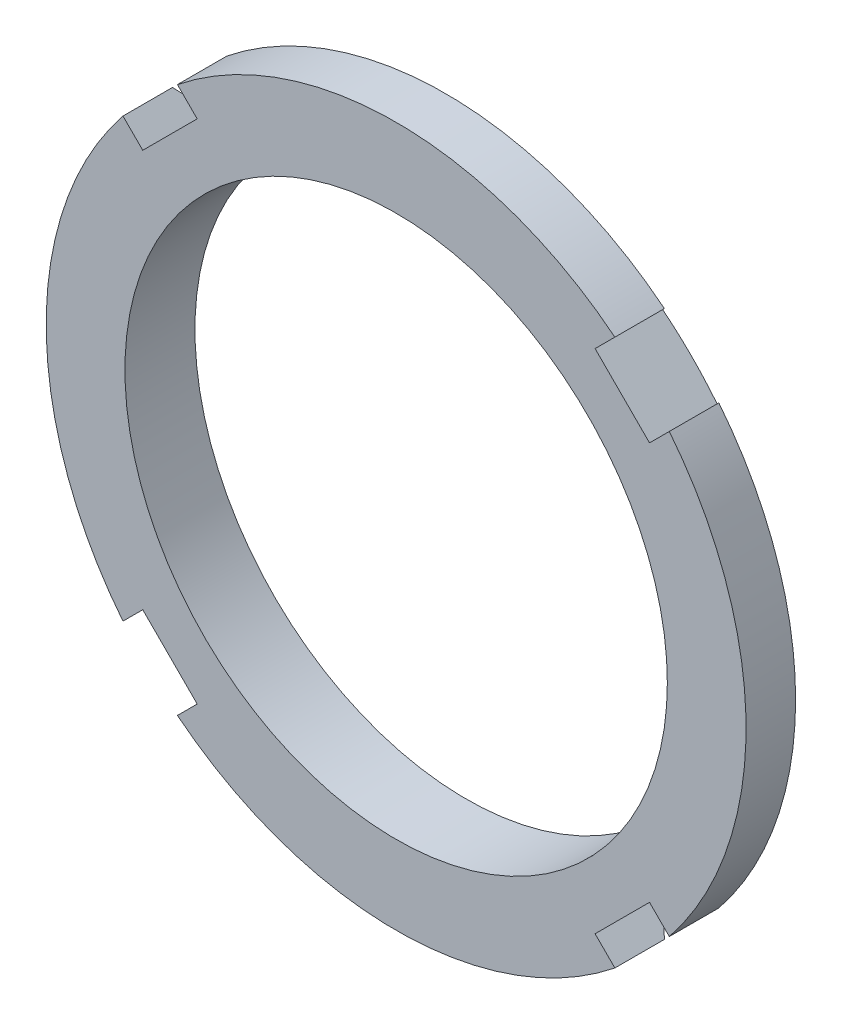
ISO-10303-21;
HEADER;
FILE_DESCRIPTION(('STEP AP214'),'2;1');
FILE_NAME('part.step','',(''),(''),'','','');
FILE_SCHEMA(('AUTOMOTIVE_DESIGN { 1 0 10303 214 1 1 1 1 }'));
ENDSEC;
DATA;
#1=APPLICATION_CONTEXT('core data for automotive mechanical design processes');
#2=APPLICATION_PROTOCOL_DEFINITION('international standard','automotive_design',2000,#1);
#3=PRODUCT_CONTEXT('',#1,'mechanical');
#4=PRODUCT('Part','Part','',(#3));
#5=PRODUCT_RELATED_PRODUCT_CATEGORY('part','',(#4));
#6=PRODUCT_DEFINITION_FORMATION('','',#4);
#7=PRODUCT_DEFINITION_CONTEXT('part definition',#1,'design');
#8=PRODUCT_DEFINITION('design','',#6,#7);
#9=PRODUCT_DEFINITION_SHAPE('','',#8);
#10=(LENGTH_UNIT() NAMED_UNIT(*) SI_UNIT(.MILLI.,.METRE.));
#11=(NAMED_UNIT(*) PLANE_ANGLE_UNIT() SI_UNIT($,.RADIAN.));
#12=(NAMED_UNIT(*) SI_UNIT($,.STERADIAN.) SOLID_ANGLE_UNIT());
#13=UNCERTAINTY_MEASURE_WITH_UNIT(LENGTH_MEASURE(1.E-05),#10,'distance_accuracy_value','');
#14=(GEOMETRIC_REPRESENTATION_CONTEXT(3) GLOBAL_UNCERTAINTY_ASSIGNED_CONTEXT((#13)) GLOBAL_UNIT_ASSIGNED_CONTEXT((#10,
#11,#12)) REPRESENTATION_CONTEXT('',''));
#15=CARTESIAN_POINT('',(0.,0.,0.));
#16=DIRECTION('',(0.,0.,1.));
#17=DIRECTION('',(1.,0.,0.));
#18=AXIS2_PLACEMENT_3D('',#15,#16,#17);
#19=CARTESIAN_POINT('',(0.,0.,10.));
#20=DIRECTION('',(0.,0.,-1.));
#21=DIRECTION('',(-1.,0.,0.));
#22=AXIS2_PLACEMENT_3D('',#19,#20,#21);
#23=CYLINDRICAL_SURFACE('',#22,50.);
#24=DIRECTION('',(0.,0.,1.));
#25=VECTOR('',#24,1.);
#26=CARTESIAN_POINT('',(-39.029875563154,31.2517009701026,0.));
#27=LINE('',#26,#25);
#28=CARTESIAN_POINT('',(-39.029875563154,31.2517009701026,2.92233416938876));
#29=VERTEX_POINT('',#28);
#30=CARTESIAN_POINT('',(-39.029875563154,31.2517009701026,10.));
#31=VERTEX_POINT('',#30);
#32=EDGE_CURVE('E255',#29,#31,#27,.T.);
#33=ORIENTED_EDGE('',*,*,#32,.F.);
#34=CARTESIAN_POINT('',(0.,0.,2.92233416938876));
#35=DIRECTION('',(0.,0.,1.));
#36=DIRECTION('',(1.,0.,0.));
#37=AXIS2_PLACEMENT_3D('',#34,#35,#36);
#38=CIRCLE('',#37,50.);
#39=CARTESIAN_POINT('',(-39.0298755631545,-31.2517009701021,2.92233416938876));
#40=VERTEX_POINT('',#39);
#41=EDGE_CURVE('E250',#29,#40,#38,.T.);
#42=ORIENTED_EDGE('',*,*,#41,.T.);
#43=DIRECTION('',(0.,0.,1.));
#44=VECTOR('',#43,1.);
#45=CARTESIAN_POINT('',(-39.0298755631545,-31.2517009701021,0.));
#46=LINE('',#45,#44);
#47=CARTESIAN_POINT('',(-39.0298755631545,-31.2517009701021,10.));
#48=VERTEX_POINT('',#47);
#49=EDGE_CURVE('E275',#40,#48,#46,.T.);
#50=ORIENTED_EDGE('',*,*,#49,.T.);
#51=CARTESIAN_POINT('',(0.,0.,10.));
#52=DIRECTION('',(0.,0.,1.));
#53=DIRECTION('',(1.,0.,0.));
#54=AXIS2_PLACEMENT_3D('',#51,#52,#53);
#55=CIRCLE('',#54,50.);
#56=EDGE_CURVE('E192',#31,#48,#55,.T.);
#57=ORIENTED_EDGE('',*,*,#56,.F.);
#58=EDGE_LOOP('',(#33,#42,#50,#57));
#59=FACE_BOUND('',#58,.T.);
#60=ADVANCED_FACE('F33',(#59),#23,.T.);
#61=DIRECTION('',(0.,0.,1.));
#62=VECTOR('',#61,1.);
#63=CARTESIAN_POINT('',(-31.2517009701025,-39.0298755631541,0.));
#64=LINE('',#63,#62);
#65=CARTESIAN_POINT('',(-31.2517009701025,-39.0298755631542,2.92233416938876));
#66=VERTEX_POINT('',#65);
#67=CARTESIAN_POINT('',(-31.2517009701025,-39.0298755631541,10.));
#68=VERTEX_POINT('',#67);
#69=EDGE_CURVE('E273',#66,#68,#64,.T.);
#70=ORIENTED_EDGE('',*,*,#69,.F.);
#71=CARTESIAN_POINT('',(31.2517009701022,-39.0298755631544,2.92233416938876));
#72=VERTEX_POINT('',#71);
#73=EDGE_CURVE('E169',#66,#72,#38,.T.);
#74=ORIENTED_EDGE('',*,*,#73,.T.);
#75=DIRECTION('',(0.,0.,1.));
#76=VECTOR('',#75,1.);
#77=CARTESIAN_POINT('',(31.2517009701022,-39.0298755631544,0.));
#78=LINE('',#77,#76);
#79=CARTESIAN_POINT('',(31.2517009701022,-39.0298755631544,10.));
#80=VERTEX_POINT('',#79);
#81=EDGE_CURVE('E218',#72,#80,#78,.T.);
#82=ORIENTED_EDGE('',*,*,#81,.T.);
#83=EDGE_CURVE('E197',#68,#80,#55,.T.);
#84=ORIENTED_EDGE('',*,*,#83,.F.);
#85=EDGE_LOOP('',(#70,#74,#82,#84));
#86=FACE_BOUND('',#85,.T.);
#87=ADVANCED_FACE('F394',(#86),#23,.T.);
#88=DIRECTION('',(0.,0.,1.));
#89=VECTOR('',#88,1.);
#90=CARTESIAN_POINT('',(39.0298755631542,-31.2517009701023,0.));
#91=LINE('',#90,#89);
#92=CARTESIAN_POINT('',(39.0298755631543,-31.2517009701023,2.92233416938876));
#93=VERTEX_POINT('',#92);
#94=CARTESIAN_POINT('',(39.0298755631542,-31.2517009701023,10.));
#95=VERTEX_POINT('',#94);
#96=EDGE_CURVE('E168',#93,#95,#91,.T.);
#97=ORIENTED_EDGE('',*,*,#96,.F.);
#98=CARTESIAN_POINT('',(39.0298755631542,31.2517009701023,2.92233416938876));
#99=VERTEX_POINT('',#98);
#100=EDGE_CURVE('E153',#93,#99,#38,.T.);
#101=ORIENTED_EDGE('',*,*,#100,.T.);
#102=DIRECTION('',(0.,0.,1.));
#103=VECTOR('',#102,1.);
#104=CARTESIAN_POINT('',(39.0298755631542,31.2517009701023,0.));
#105=LINE('',#104,#103);
#106=CARTESIAN_POINT('',(39.0298755631542,31.2517009701023,10.));
#107=VERTEX_POINT('',#106);
#108=EDGE_CURVE('E166',#99,#107,#105,.T.);
#109=ORIENTED_EDGE('',*,*,#108,.T.);
#110=EDGE_CURVE('E188',#95,#107,#55,.T.);
#111=ORIENTED_EDGE('',*,*,#110,.F.);
#112=EDGE_LOOP('',(#97,#101,#109,#111));
#113=FACE_BOUND('',#112,.T.);
#114=ADVANCED_FACE('F164',(#113),#23,.T.);
#115=CARTESIAN_POINT('',(0.,0.,10.));
#116=DIRECTION('',(0.,0.,1.));
#117=DIRECTION('',(1.,0.,0.));
#118=AXIS2_PLACEMENT_3D('',#115,#116,#117);
#119=PLANE('',#118);
#120=DIRECTION('',(0.707106781186542,-0.707106781186553,0.));
#121=VECTOR('',#120,1.);
#122=CARTESIAN_POINT('',(-39.029875563154,31.2517009701026,10.));
#123=LINE('',#122,#121);
#124=CARTESIAN_POINT('',(-36.203867196751,28.4256926036995,10.));
#125=VERTEX_POINT('',#124);
#126=EDGE_CURVE('E260',#31,#125,#123,.T.);
#127=ORIENTED_EDGE('',*,*,#126,.F.);
#128=ORIENTED_EDGE('',*,*,#56,.T.);
#129=DIRECTION('',(-0.707106781186552,-0.707106781186543,0.));
#130=VECTOR('',#129,1.);
#131=CARTESIAN_POINT('',(-39.0298755631545,-31.2517009701021,10.));
#132=LINE('',#131,#130);
#133=CARTESIAN_POINT('',(-36.2038671967514,-28.425692603699,10.));
#134=VERTEX_POINT('',#133);
#135=EDGE_CURVE('E267',#134,#48,#132,.T.);
#136=ORIENTED_EDGE('',*,*,#135,.F.);
#137=DIRECTION('',(-0.707106781186544,0.707106781186551,0.));
#138=VECTOR('',#137,1.);
#139=CARTESIAN_POINT('',(-28.4256926036994,-36.2038671967511,10.));
#140=LINE('',#139,#138);
#141=CARTESIAN_POINT('',(-28.4256926036994,-36.2038671967511,10.));
#142=VERTEX_POINT('',#141);
#143=EDGE_CURVE('E264',#142,#134,#140,.T.);
#144=ORIENTED_EDGE('',*,*,#143,.F.);
#145=DIRECTION('',(0.70710678118655,0.707106781186545,0.));
#146=VECTOR('',#145,1.);
#147=CARTESIAN_POINT('',(-31.2517009701025,-39.0298755631541,10.));
#148=LINE('',#147,#146);
#149=EDGE_CURVE('E211',#68,#142,#148,.T.);
#150=ORIENTED_EDGE('',*,*,#149,.F.);
#151=ORIENTED_EDGE('',*,*,#83,.T.);
#152=DIRECTION('',(0.707106781186545,-0.70710678118655,0.));
#153=VECTOR('',#152,1.);
#154=CARTESIAN_POINT('',(31.2517009701022,-39.0298755631544,10.));
#155=LINE('',#154,#153);
#156=CARTESIAN_POINT('',(28.4256926036992,-36.2038671967513,10.));
#157=VERTEX_POINT('',#156);
#158=EDGE_CURVE('E208',#157,#80,#155,.T.);
#159=ORIENTED_EDGE('',*,*,#158,.F.);
#160=DIRECTION('',(-0.707106781186549,-0.707106781186546,0.));
#161=VECTOR('',#160,1.);
#162=CARTESIAN_POINT('',(36.2038671967512,-28.4256926036993,10.));
#163=LINE('',#162,#161);
#164=CARTESIAN_POINT('',(36.2038671967512,-28.4256926036993,10.));
#165=VERTEX_POINT('',#164);
#166=EDGE_CURVE('E223',#165,#157,#163,.T.);
#167=ORIENTED_EDGE('',*,*,#166,.F.);
#168=DIRECTION('',(-0.707106781186547,0.707106781186548,0.));
#169=VECTOR('',#168,1.);
#170=CARTESIAN_POINT('',(39.0298755631542,-31.2517009701023,10.));
#171=LINE('',#170,#169);
#172=EDGE_CURVE('E222',#95,#165,#171,.T.);
#173=ORIENTED_EDGE('',*,*,#172,.F.);
#174=ORIENTED_EDGE('',*,*,#110,.T.);
#175=DIRECTION('',(0.707106781186548,0.707106781186548,0.));
#176=VECTOR('',#175,1.);
#177=CARTESIAN_POINT('',(39.0298755631542,31.2517009701023,10.));
#178=LINE('',#177,#176);
#179=CARTESIAN_POINT('',(36.2038671967512,28.4256926036993,10.));
#180=VERTEX_POINT('',#179);
#181=EDGE_CURVE('E175',#180,#107,#178,.T.);
#182=ORIENTED_EDGE('',*,*,#181,.F.);
#183=DIRECTION('',(0.707106781186549,-0.707106781186546,0.));
#184=VECTOR('',#183,1.);
#185=CARTESIAN_POINT('',(28.4256926036991,36.2038671967513,10.));
#186=LINE('',#185,#184);
#187=CARTESIAN_POINT('',(28.4256926036991,36.2038671967513,10.));
#188=VERTEX_POINT('',#187);
#189=EDGE_CURVE('E233',#188,#180,#186,.T.);
#190=ORIENTED_EDGE('',*,*,#189,.F.);
#191=DIRECTION('',(-0.707106781186545,-0.70710678118655,0.));
#192=VECTOR('',#191,1.);
#193=CARTESIAN_POINT('',(31.2517009701022,39.0298755631544,10.));
#194=LINE('',#193,#192);
#195=CARTESIAN_POINT('',(31.2517009701022,39.0298755631544,10.));
#196=VERTEX_POINT('',#195);
#197=EDGE_CURVE('E181',#196,#188,#194,.T.);
#198=ORIENTED_EDGE('',*,*,#197,.F.);
#199=CARTESIAN_POINT('',(-31.2517009701019,39.0298755631546,10.));
#200=VERTEX_POINT('',#199);
#201=EDGE_CURVE('E46',#196,#200,#55,.T.);
#202=ORIENTED_EDGE('',*,*,#201,.T.);
#203=DIRECTION('',(-0.70710678118654,0.707106781186555,0.));
#204=VECTOR('',#203,1.);
#205=CARTESIAN_POINT('',(-31.2517009701019,39.0298755631546,10.));
#206=LINE('',#205,#204);
#207=CARTESIAN_POINT('',(-28.4256926036989,36.2038671967515,10.));
#208=VERTEX_POINT('',#207);
#209=EDGE_CURVE('E254',#208,#200,#206,.T.);
#210=ORIENTED_EDGE('',*,*,#209,.F.);
#211=DIRECTION('',(0.707106781186554,0.707106781186541,0.));
#212=VECTOR('',#211,1.);
#213=CARTESIAN_POINT('',(-36.203867196751,28.4256926036995,10.));
#214=LINE('',#213,#212);
#215=EDGE_CURVE('E408',#125,#208,#214,.T.);
#216=ORIENTED_EDGE('',*,*,#215,.F.);
#217=EDGE_LOOP('',(#127,#128,#136,#144,#150,#151,#159,#167,#173,#174,#182,#190,#198,#202,#210,#216));
#218=FACE_BOUND('',#217,.T.);
#219=CARTESIAN_POINT('',(0.,0.,10.));
#220=DIRECTION('',(0.,0.,1.));
#221=DIRECTION('',(1.,0.,0.));
#222=AXIS2_PLACEMENT_3D('',#219,#220,#221);
#223=CIRCLE('',#222,38.75);
#224=CARTESIAN_POINT('',(38.75,0.,10.));
#225=VERTEX_POINT('',#224);
#226=EDGE_CURVE('E185',#225,#225,#223,.T.);
#227=ORIENTED_EDGE('',*,*,#226,.F.);
#228=EDGE_LOOP('',(#227));
#229=FACE_BOUND('',#228,.T.);
#230=ADVANCED_FACE('F205',(#218,#229),#119,.T.);
#231=CARTESIAN_POINT('',(0.,0.,0.));
#232=DIRECTION('',(0.,0.,1.));
#233=DIRECTION('',(1.,0.,0.));
#234=AXIS2_PLACEMENT_3D('',#231,#232,#233);
#235=PLANE('',#234);
#236=CARTESIAN_POINT('',(0.,0.,0.));
#237=DIRECTION('',(0.,0.,1.));
#238=DIRECTION('',(1.,0.,0.));
#239=AXIS2_PLACEMENT_3D('',#236,#237,#238);
#240=CIRCLE('',#239,45.5);
#241=CARTESIAN_POINT('',(45.5,0.,0.));
#242=VERTEX_POINT('',#241);
#243=EDGE_CURVE('E249',#242,#242,#240,.T.);
#244=ORIENTED_EDGE('',*,*,#243,.F.);
#245=EDGE_LOOP('',(#244));
#246=FACE_BOUND('',#245,.T.);
#247=CARTESIAN_POINT('',(0.,0.,0.));
#248=DIRECTION('',(0.,0.,1.));
#249=DIRECTION('',(1.,0.,0.));
#250=AXIS2_PLACEMENT_3D('',#247,#248,#249);
#251=CIRCLE('',#250,38.75);
#252=CARTESIAN_POINT('',(38.75,0.,0.));
#253=VERTEX_POINT('',#252);
#254=EDGE_CURVE('E189',#253,#253,#251,.T.);
#255=ORIENTED_EDGE('',*,*,#254,.T.);
#256=EDGE_LOOP('',(#255));
#257=FACE_BOUND('',#256,.T.);
#258=ADVANCED_FACE('F385',(#246,#257),#235,.F.);
#259=DIRECTION('',(0.,0.,1.));
#260=VECTOR('',#259,1.);
#261=CARTESIAN_POINT('',(31.2517009701022,39.0298755631544,0.));
#262=LINE('',#261,#260);
#263=CARTESIAN_POINT('',(31.2517009701022,39.0298755631544,2.92233416938876));
#264=VERTEX_POINT('',#263);
#265=EDGE_CURVE('E176',#264,#196,#262,.T.);
#266=ORIENTED_EDGE('',*,*,#265,.F.);
#267=CARTESIAN_POINT('',(-31.2517009701019,39.0298755631546,2.92233416938876));
#268=VERTEX_POINT('',#267);
#269=EDGE_CURVE('E171',#264,#268,#38,.T.);
#270=ORIENTED_EDGE('',*,*,#269,.T.);
#271=DIRECTION('',(0.,0.,1.));
#272=VECTOR('',#271,1.);
#273=CARTESIAN_POINT('',(-31.2517009701019,39.0298755631546,0.));
#274=LINE('',#273,#272);
#275=EDGE_CURVE('E60',#268,#200,#274,.T.);
#276=ORIENTED_EDGE('',*,*,#275,.T.);
#277=ORIENTED_EDGE('',*,*,#201,.F.);
#278=EDGE_LOOP('',(#266,#270,#276,#277));
#279=FACE_BOUND('',#278,.T.);
#280=ADVANCED_FACE('F35',(#279),#23,.T.);
#281=CARTESIAN_POINT('',(0.,0.,10.));
#282=DIRECTION('',(0.,0.,-1.));
#283=DIRECTION('',(-1.,0.,0.));
#284=AXIS2_PLACEMENT_3D('',#281,#282,#283);
#285=CYLINDRICAL_SURFACE('',#284,38.75);
#286=ORIENTED_EDGE('',*,*,#226,.T.);
#287=EDGE_LOOP('',(#286));
#288=FACE_BOUND('',#287,.T.);
#289=ORIENTED_EDGE('',*,*,#254,.F.);
#290=EDGE_LOOP('',(#289));
#291=FACE_BOUND('',#290,.T.);
#292=ADVANCED_FACE('F379',(#288,#291),#285,.F.);
#293=CARTESIAN_POINT('',(28.4256926036991,36.2038671967513,0.));
#294=DIRECTION('',(-0.707106781186546,-0.707106781186549,0.));
#295=DIRECTION('',(0.707106781186549,-0.707106781186546,0.));
#296=AXIS2_PLACEMENT_3D('',#293,#294,#295);
#297=PLANE('',#296);
#298=DIRECTION('',(0.,0.,1.));
#299=VECTOR('',#298,1.);
#300=CARTESIAN_POINT('',(36.2038671967512,28.4256926036993,0.));
#301=LINE('',#300,#299);
#302=CARTESIAN_POINT('',(36.2038671967512,28.4256926036993,0.344038591718503));
#303=VERTEX_POINT('',#302);
#304=EDGE_CURVE('E177',#303,#180,#301,.T.);
#305=ORIENTED_EDGE('',*,*,#304,.F.);
#306=CARTESIAN_POINT('',(36.2040671967512,28.4254926036993,0.344060539833136));
#307=CARTESIAN_POINT('',(35.8803581287333,28.7492016717172,0.308531484594854));
#308=CARTESIAN_POINT('',(35.556416429512,29.0731433709385,0.277357668174083));
#309=CARTESIAN_POINT('',(34.908166729728,29.7213930707225,0.223825816086874));
#310=CARTESIAN_POINT('',(34.5838587263443,30.0457010741061,0.20146784878523));
#311=CARTESIAN_POINT('',(33.6115550066865,31.0180047937639,0.147832326833317));
#312=CARTESIAN_POINT('',(32.9631674534558,31.6663923469946,0.129881518639509));
#313=CARTESIAN_POINT('',(31.6663923469945,32.963167453456,0.129881518639509));
#314=CARTESIAN_POINT('',(31.0180047937638,33.6115550066866,0.147832326833317));
#315=CARTESIAN_POINT('',(30.045701074106,34.5838587263444,0.201467848785231));
#316=CARTESIAN_POINT('',(29.7213930707223,34.9081667297281,0.223825816086876));
#317=CARTESIAN_POINT('',(29.0731433709384,35.5564164295121,0.277357668174086));
#318=CARTESIAN_POINT('',(28.749201671717,35.8803581287334,0.308531484594859));
#319=CARTESIAN_POINT('',(28.4254926036991,36.2040671967513,0.34406053983314));
#320=B_SPLINE_CURVE_WITH_KNOTS('',3,(#306,#307,#308,#309,#310,#311,#312,#313,#314,#315,#316,
#317,#318,#319),.UNSPECIFIED.,.F.,.F.,(4,2,2,2,2,2,4),(0.,1.37747131070928,2.75495330316771,
5.50561311074742,8.25627291832713,9.63375491078556,11.0112262214948),.UNSPECIFIED.);
#321=CARTESIAN_POINT('',(28.4256926036991,36.2038671967513,0.344038591718506));
#322=VERTEX_POINT('',#321);
#323=EDGE_CURVE('E156',#303,#322,#320,.T.);
#324=ORIENTED_EDGE('',*,*,#323,.T.);
#325=DIRECTION('',(0.,0.,1.));
#326=VECTOR('',#325,1.);
#327=CARTESIAN_POINT('',(28.4256926036991,36.2038671967513,0.));
#328=LINE('',#327,#326);
#329=EDGE_CURVE('E179',#322,#188,#328,.T.);
#330=ORIENTED_EDGE('',*,*,#329,.T.);
#331=ORIENTED_EDGE('',*,*,#189,.T.);
#332=EDGE_LOOP('',(#305,#324,#330,#331));
#333=FACE_BOUND('',#332,.T.);
#334=ADVANCED_FACE('F243',(#333),#297,.F.);
#335=CARTESIAN_POINT('',(31.2517009701022,39.0298755631544,0.));
#336=DIRECTION('',(-0.70710678118655,0.707106781186545,0.));
#337=DIRECTION('',(-0.707106781186545,-0.70710678118655,0.));
#338=AXIS2_PLACEMENT_3D('',#335,#336,#337);
#339=PLANE('',#338);
#340=ORIENTED_EDGE('',*,*,#329,.F.);
#341=CARTESIAN_POINT('',(28.4254926036991,36.2036671967513,0.343856227468963));
#342=CARTESIAN_POINT('',(28.8966369074373,36.6748115004895,0.773465844116193));
#343=CARTESIAN_POINT('',(29.3677430899932,37.1459176830454,1.20315902820334));
#344=CARTESIAN_POINT('',(30.3098792121275,38.0880538051796,2.0627125306982));
#345=CARTESIAN_POINT('',(30.7809091517059,38.5590837447581,2.4925728491057));
#346=CARTESIAN_POINT('',(31.2519009701022,39.0300755631544,2.92251673495289));
#347=B_SPLINE_CURVE_WITH_KNOTS('',3,(#341,#342,#343,#344,#345,#346),.UNSPECIFIED.,.F.,.F.,(4,2,
4),(0.,2.37837438735404,4.75674877161307),.UNSPECIFIED.);
#348=EDGE_CURVE('E370',#322,#264,#347,.T.);
#349=ORIENTED_EDGE('',*,*,#348,.T.);
#350=ORIENTED_EDGE('',*,*,#265,.T.);
#351=ORIENTED_EDGE('',*,*,#197,.T.);
#352=EDGE_LOOP('',(#340,#349,#350,#351));
#353=FACE_BOUND('',#352,.T.);
#354=ADVANCED_FACE('F247',(#353),#339,.F.);
#355=CARTESIAN_POINT('',(39.0298755631542,31.2517009701023,0.));
#356=DIRECTION('',(0.707106781186548,-0.707106781186548,0.));
#357=DIRECTION('',(0.707106781186548,0.707106781186548,0.));
#358=AXIS2_PLACEMENT_3D('',#355,#356,#357);
#359=PLANE('',#358);
#360=ORIENTED_EDGE('',*,*,#108,.F.);
#361=CARTESIAN_POINT('',(39.0300755631542,31.2519009701023,2.92251673495291));
#362=CARTESIAN_POINT('',(38.559083744758,30.7809091517061,2.49257284910571));
#363=CARTESIAN_POINT('',(38.0880538051795,30.3098792121276,2.06271253069821));
#364=CARTESIAN_POINT('',(37.1459176830453,29.3677430899934,1.20315902820334));
#365=CARTESIAN_POINT('',(36.6748115004894,28.8966369074375,0.773465844116191));
#366=CARTESIAN_POINT('',(36.2036671967512,28.4254926036993,0.343856227468958));
#367=B_SPLINE_CURVE_WITH_KNOTS('',3,(#361,#362,#363,#364,#365,#366),.UNSPECIFIED.,.F.,.F.,(4,2,
4),(0.,2.37837438425904,4.75674877161309),.UNSPECIFIED.);
#368=EDGE_CURVE('E150',#99,#303,#367,.T.);
#369=ORIENTED_EDGE('',*,*,#368,.T.);
#370=ORIENTED_EDGE('',*,*,#304,.T.);
#371=ORIENTED_EDGE('',*,*,#181,.T.);
#372=EDGE_LOOP('',(#360,#369,#370,#371));
#373=FACE_BOUND('',#372,.T.);
#374=ADVANCED_FACE('F173',(#373),#359,.F.);
#375=CARTESIAN_POINT('',(36.2038671967512,-28.4256926036993,0.));
#376=DIRECTION('',(-0.707106781186546,0.707106781186549,0.));
#377=DIRECTION('',(-0.707106781186549,-0.707106781186546,0.));
#378=AXIS2_PLACEMENT_3D('',#375,#376,#377);
#379=PLANE('',#378);
#380=DIRECTION('',(0.,0.,1.));
#381=VECTOR('',#380,1.);
#382=CARTESIAN_POINT('',(28.4256926036992,-36.2038671967513,0.));
#383=LINE('',#382,#381);
#384=CARTESIAN_POINT('',(28.4256926036992,-36.2038671967513,0.344038591718503));
#385=VERTEX_POINT('',#384);
#386=EDGE_CURVE('E220',#385,#157,#383,.T.);
#387=ORIENTED_EDGE('',*,*,#386,.F.);
#388=CARTESIAN_POINT('',(28.4254926036992,-36.2040671967513,0.344060539833137));
#389=CARTESIAN_POINT('',(28.7492016717171,-35.8803581287334,0.308531484594855));
#390=CARTESIAN_POINT('',(29.0731433709384,-35.5564164295121,0.277357668174083));
#391=CARTESIAN_POINT('',(29.7213930707223,-34.9081667297281,0.223825816086875));
#392=CARTESIAN_POINT('',(30.045701074106,-34.5838587263444,0.201467848785231));
#393=CARTESIAN_POINT('',(31.0180047937638,-33.6115550066866,0.147832326833318));
#394=CARTESIAN_POINT('',(31.6663923469945,-32.963167453456,0.129881518639509));
#395=CARTESIAN_POINT('',(32.9631674534559,-31.6663923469946,0.129881518639509));
#396=CARTESIAN_POINT('',(33.6115550066865,-31.0180047937639,0.147832326833318));
#397=CARTESIAN_POINT('',(34.5838587263443,-30.0457010741061,0.201467848785231));
#398=CARTESIAN_POINT('',(34.908166729728,-29.7213930707224,0.223825816086875));
#399=CARTESIAN_POINT('',(35.556416429512,-29.0731433709385,0.277357668174085));
#400=CARTESIAN_POINT('',(35.8803581287333,-28.7492016717172,0.308531484594857));
#401=CARTESIAN_POINT('',(36.2040671967512,-28.4254926036993,0.34406053983314));
#402=B_SPLINE_CURVE_WITH_KNOTS('',3,(#388,#389,#390,#391,#392,#393,#394,#395,#396,#397,#398,
#399,#400,#401),.UNSPECIFIED.,.F.,.F.,(4,2,2,2,2,2,4),(0.,1.37747131070928,2.75495330316771,
5.50561311074742,8.25627291832713,9.63375491078557,11.0112262214948),.UNSPECIFIED.);
#403=CARTESIAN_POINT('',(36.2038671967512,-28.4256926036993,0.344038591718506));
#404=VERTEX_POINT('',#403);
#405=EDGE_CURVE('E350',#385,#404,#402,.T.);
#406=ORIENTED_EDGE('',*,*,#405,.T.);
#407=DIRECTION('',(0.,0.,1.));
#408=VECTOR('',#407,1.);
#409=CARTESIAN_POINT('',(36.2038671967512,-28.4256926036993,0.));
#410=LINE('',#409,#408);
#411=EDGE_CURVE('E231',#404,#165,#410,.T.);
#412=ORIENTED_EDGE('',*,*,#411,.T.);
#413=ORIENTED_EDGE('',*,*,#166,.T.);
#414=EDGE_LOOP('',(#387,#406,#412,#413));
#415=FACE_BOUND('',#414,.T.);
#416=ADVANCED_FACE('F426',(#415),#379,.F.);
#417=CARTESIAN_POINT('',(39.0298755631542,-31.2517009701023,0.));
#418=DIRECTION('',(0.707106781186548,0.707106781186547,0.));
#419=DIRECTION('',(-0.707106781186547,0.707106781186548,0.));
#420=AXIS2_PLACEMENT_3D('',#417,#418,#419);
#421=PLANE('',#420);
#422=ORIENTED_EDGE('',*,*,#411,.F.);
#423=CARTESIAN_POINT('',(36.2036671967512,-28.4254926036993,0.343856227468968));
#424=CARTESIAN_POINT('',(36.6748115004894,-28.8966369074375,0.773465844116197));
#425=CARTESIAN_POINT('',(37.1459176830453,-29.3677430899934,1.20315902820335));
#426=CARTESIAN_POINT('',(38.0880538051795,-30.3098792121276,2.06271253069821));
#427=CARTESIAN_POINT('',(38.559083744758,-30.7809091517061,2.4925728491057));
#428=CARTESIAN_POINT('',(39.0300755631542,-31.2519009701023,2.92251673495289));
#429=B_SPLINE_CURVE_WITH_KNOTS('',3,(#423,#424,#425,#426,#427,#428),.UNSPECIFIED.,.F.,.F.,(4,2,
4),(0.,2.37837438735404,4.75674877161306),.UNSPECIFIED.);
#430=EDGE_CURVE('E160',#404,#93,#429,.T.);
#431=ORIENTED_EDGE('',*,*,#430,.T.);
#432=ORIENTED_EDGE('',*,*,#96,.T.);
#433=ORIENTED_EDGE('',*,*,#172,.T.);
#434=EDGE_LOOP('',(#422,#431,#432,#433));
#435=FACE_BOUND('',#434,.T.);
#436=ADVANCED_FACE('F423',(#435),#421,.F.);
#437=CARTESIAN_POINT('',(31.2517009701022,-39.0298755631544,0.));
#438=DIRECTION('',(-0.70710678118655,-0.707106781186545,0.));
#439=DIRECTION('',(0.707106781186545,-0.70710678118655,0.));
#440=AXIS2_PLACEMENT_3D('',#437,#438,#439);
#441=PLANE('',#440);
#442=ORIENTED_EDGE('',*,*,#81,.F.);
#443=CARTESIAN_POINT('',(31.2519009701022,-39.0300755631544,2.92251673495291));
#444=CARTESIAN_POINT('',(30.7809091517059,-38.5590837447581,2.49257284910571));
#445=CARTESIAN_POINT('',(30.3098792121275,-38.0880538051796,2.06271253069821));
#446=CARTESIAN_POINT('',(29.3677430899932,-37.1459176830454,1.20315902820334));
#447=CARTESIAN_POINT('',(28.8966369074373,-36.6748115004895,0.773465844116194));
#448=CARTESIAN_POINT('',(28.4254926036992,-36.2036671967513,0.343856227468963));
#449=B_SPLINE_CURVE_WITH_KNOTS('',3,(#443,#444,#445,#446,#447,#448),.UNSPECIFIED.,.F.,.F.,(4,2,
4),(0.,2.37837438425903,4.75674877161308),.UNSPECIFIED.);
#450=EDGE_CURVE('E343',#72,#385,#449,.T.);
#451=ORIENTED_EDGE('',*,*,#450,.T.);
#452=ORIENTED_EDGE('',*,*,#386,.T.);
#453=ORIENTED_EDGE('',*,*,#158,.T.);
#454=EDGE_LOOP('',(#442,#451,#452,#453));
#455=FACE_BOUND('',#454,.T.);
#456=ADVANCED_FACE('F216',(#455),#441,.F.);
#457=CARTESIAN_POINT('',(-28.4256926036994,-36.2038671967511,0.));
#458=DIRECTION('',(0.707106781186551,0.707106781186544,0.));
#459=DIRECTION('',(-0.707106781186544,0.707106781186551,0.));
#460=AXIS2_PLACEMENT_3D('',#457,#458,#459);
#461=PLANE('',#460);
#462=DIRECTION('',(0.,0.,1.));
#463=VECTOR('',#462,1.);
#464=CARTESIAN_POINT('',(-36.2038671967514,-28.425692603699,0.));
#465=LINE('',#464,#463);
#466=CARTESIAN_POINT('',(-36.2038671967514,-28.425692603699,0.344038591718505));
#467=VERTEX_POINT('',#466);
#468=EDGE_CURVE('E271',#467,#134,#465,.T.);
#469=ORIENTED_EDGE('',*,*,#468,.F.);
#470=CARTESIAN_POINT('',(-36.2040671967514,-28.425492603699,0.344060539833136));
#471=CARTESIAN_POINT('',(-35.8803581287335,-28.7492016717169,0.308531484594854));
#472=CARTESIAN_POINT('',(-35.5564164295122,-29.0731433709382,0.277357668174084));
#473=CARTESIAN_POINT('',(-34.9081667297282,-29.7213930707222,0.223825816086876));
#474=CARTESIAN_POINT('',(-34.5838587263445,-30.0457010741059,0.201467848785232));
#475=CARTESIAN_POINT('',(-33.6115550066867,-31.0180047937637,0.147832326833316));
#476=CARTESIAN_POINT('',(-32.9631674534561,-31.6663923469944,0.129881518639503));
#477=CARTESIAN_POINT('',(-31.6663923469947,-32.9631674534557,0.129881518639507));
#478=CARTESIAN_POINT('',(-31.018004793764,-33.6115550066864,0.147832326833325));
#479=CARTESIAN_POINT('',(-30.0457010741063,-34.5838587263442,0.201467848785234));
#480=CARTESIAN_POINT('',(-29.7213930707226,-34.9081667297279,0.223825816086874));
#481=CARTESIAN_POINT('',(-29.0731433709386,-35.5564164295119,0.277357668174079));
#482=CARTESIAN_POINT('',(-28.7492016717173,-35.8803581287332,0.30853148459485));
#483=CARTESIAN_POINT('',(-28.4254926036994,-36.2040671967511,0.34406053983314));
#484=B_SPLINE_CURVE_WITH_KNOTS('',3,(#470,#471,#472,#473,#474,#475,#476,#477,#478,#479,#480,
#481,#482,#483),.UNSPECIFIED.,.F.,.F.,(4,2,2,2,2,2,4),(0.,1.37747131070928,2.75495330316771,
5.50561311074743,8.25627291832714,9.63375491078557,11.0112262214948),.UNSPECIFIED.);
#485=CARTESIAN_POINT('',(-28.4256926036994,-36.2038671967511,0.344038591718506));
#486=VERTEX_POINT('',#485);
#487=EDGE_CURVE('E330',#467,#486,#484,.T.);
#488=ORIENTED_EDGE('',*,*,#487,.T.);
#489=DIRECTION('',(0.,0.,1.));
#490=VECTOR('',#489,1.);
#491=CARTESIAN_POINT('',(-28.4256926036994,-36.2038671967511,0.));
#492=LINE('',#491,#490);
#493=EDGE_CURVE('E227',#486,#142,#492,.T.);
#494=ORIENTED_EDGE('',*,*,#493,.T.);
#495=ORIENTED_EDGE('',*,*,#143,.T.);
#496=EDGE_LOOP('',(#469,#488,#494,#495));
#497=FACE_BOUND('',#496,.T.);
#498=ADVANCED_FACE('F285',(#497),#461,.F.);
#499=CARTESIAN_POINT('',(-31.2517009701025,-39.0298755631541,0.));
#500=DIRECTION('',(0.707106781186545,-0.70710678118655,0.));
#501=DIRECTION('',(0.70710678118655,0.707106781186545,0.));
#502=AXIS2_PLACEMENT_3D('',#499,#500,#501);
#503=PLANE('',#502);
#504=ORIENTED_EDGE('',*,*,#493,.F.);
#505=CARTESIAN_POINT('',(-28.4254926036994,-36.2036671967511,0.343856227468963));
#506=CARTESIAN_POINT('',(-28.8966369074376,-36.6748115004893,0.773465844116192));
#507=CARTESIAN_POINT('',(-29.3677430899935,-37.1459176830452,1.20315902820334));
#508=CARTESIAN_POINT('',(-30.3098792121277,-38.0880538051794,2.06271253069821));
#509=CARTESIAN_POINT('',(-30.7809091517062,-38.5590837447579,2.4925728491057));
#510=CARTESIAN_POINT('',(-31.2519009701025,-39.0300755631541,2.9225167349529));
#511=B_SPLINE_CURVE_WITH_KNOTS('',3,(#505,#506,#507,#508,#509,#510),.UNSPECIFIED.,.F.,.F.,(4,2,
4),(0.,2.37837438735404,4.75674877161307),.UNSPECIFIED.);
#512=EDGE_CURVE('E337',#486,#66,#511,.T.);
#513=ORIENTED_EDGE('',*,*,#512,.T.);
#514=ORIENTED_EDGE('',*,*,#69,.T.);
#515=ORIENTED_EDGE('',*,*,#149,.T.);
#516=EDGE_LOOP('',(#504,#513,#514,#515));
#517=FACE_BOUND('',#516,.T.);
#518=ADVANCED_FACE('F403',(#517),#503,.F.);
#519=CARTESIAN_POINT('',(-39.0298755631545,-31.2517009701021,0.));
#520=DIRECTION('',(-0.707106781186543,0.707106781186552,0.));
#521=DIRECTION('',(-0.707106781186552,-0.707106781186543,0.));
#522=AXIS2_PLACEMENT_3D('',#519,#520,#521);
#523=PLANE('',#522);
#524=ORIENTED_EDGE('',*,*,#49,.F.);
#525=CARTESIAN_POINT('',(-39.0300755631545,-31.2519009701021,2.9225167349529));
#526=CARTESIAN_POINT('',(-38.5590837447582,-30.7809091517058,2.4925728491057));
#527=CARTESIAN_POINT('',(-38.0880538051797,-30.3098792121274,2.06271253069821));
#528=CARTESIAN_POINT('',(-37.1459176830455,-29.3677430899931,1.20315902820334));
#529=CARTESIAN_POINT('',(-36.6748115004896,-28.8966369074372,0.773465844116194));
#530=CARTESIAN_POINT('',(-36.2036671967514,-28.425492603699,0.343856227468963));
#531=B_SPLINE_CURVE_WITH_KNOTS('',3,(#525,#526,#527,#528,#529,#530),.UNSPECIFIED.,.F.,.F.,(4,2,
4),(0.,2.37837438425903,4.75674877161308),.UNSPECIFIED.);
#532=EDGE_CURVE('E282',#40,#467,#531,.T.);
#533=ORIENTED_EDGE('',*,*,#532,.T.);
#534=ORIENTED_EDGE('',*,*,#468,.T.);
#535=ORIENTED_EDGE('',*,*,#135,.T.);
#536=EDGE_LOOP('',(#524,#533,#534,#535));
#537=FACE_BOUND('',#536,.T.);
#538=ADVANCED_FACE('F280',(#537),#523,.F.);
#539=CARTESIAN_POINT('',(-36.203867196751,28.4256926036995,0.));
#540=DIRECTION('',(0.707106781186541,-0.707106781186554,0.));
#541=DIRECTION('',(0.707106781186554,0.707106781186541,0.));
#542=AXIS2_PLACEMENT_3D('',#539,#540,#541);
#543=PLANE('',#542);
#544=DIRECTION('',(0.,0.,1.));
#545=VECTOR('',#544,1.);
#546=CARTESIAN_POINT('',(-28.4256926036989,36.2038671967515,0.));
#547=LINE('',#546,#545);
#548=CARTESIAN_POINT('',(-28.4256926036989,36.2038671967515,0.344038591718505));
#549=VERTEX_POINT('',#548);
#550=EDGE_CURVE('E256',#549,#208,#547,.T.);
#551=ORIENTED_EDGE('',*,*,#550,.F.);
#552=CARTESIAN_POINT('',(-28.4254926036989,36.2040671967515,0.344060539833137));
#553=CARTESIAN_POINT('',(-28.7492016717168,35.8803581287336,0.308531484594852));
#554=CARTESIAN_POINT('',(-29.0731433709381,35.5564164295123,0.277357668174081));
#555=CARTESIAN_POINT('',(-29.7213930707221,34.9081667297283,0.223825816086872));
#556=CARTESIAN_POINT('',(-30.0457010741058,34.5838587263446,0.201467848785228));
#557=CARTESIAN_POINT('',(-31.0180047937636,33.6115550066868,0.147832326833315));
#558=CARTESIAN_POINT('',(-31.6663923469943,32.9631674534562,0.129881518639503));
#559=CARTESIAN_POINT('',(-32.9631674534556,31.6663923469948,0.129881518639507));
#560=CARTESIAN_POINT('',(-33.6115550066863,31.0180047937642,0.147832326833321));
#561=CARTESIAN_POINT('',(-34.5838587263441,30.0457010741064,0.201467848785232));
#562=CARTESIAN_POINT('',(-34.9081667297278,29.7213930707227,0.223825816086873));
#563=CARTESIAN_POINT('',(-35.5564164295118,29.0731433709387,0.27735766817408));
#564=CARTESIAN_POINT('',(-35.8803581287331,28.7492016717174,0.308531484594852));
#565=CARTESIAN_POINT('',(-36.204067196751,28.4254926036995,0.34406053983314));
#566=B_SPLINE_CURVE_WITH_KNOTS('',3,(#552,#553,#554,#555,#556,#557,#558,#559,#560,#561,#562,
#563,#564,#565),.UNSPECIFIED.,.F.,.F.,(4,2,2,2,2,2,4),(0.,1.37747131070928,2.75495330316771,
5.50561311074742,8.25627291832713,9.63375491078557,11.0112262214948),.UNSPECIFIED.);
#567=CARTESIAN_POINT('',(-36.203867196751,28.4256926036995,0.344038591718506));
#568=VERTEX_POINT('',#567);
#569=EDGE_CURVE('E53',#549,#568,#566,.T.);
#570=ORIENTED_EDGE('',*,*,#569,.T.);
#571=DIRECTION('',(0.,0.,1.));
#572=VECTOR('',#571,1.);
#573=CARTESIAN_POINT('',(-36.203867196751,28.4256926036995,0.));
#574=LINE('',#573,#572);
#575=EDGE_CURVE('E258',#568,#125,#574,.T.);
#576=ORIENTED_EDGE('',*,*,#575,.T.);
#577=ORIENTED_EDGE('',*,*,#215,.T.);
#578=EDGE_LOOP('',(#551,#570,#576,#577));
#579=FACE_BOUND('',#578,.T.);
#580=ADVANCED_FACE('F309',(#579),#543,.F.);
#581=CARTESIAN_POINT('',(-39.029875563154,31.2517009701026,0.));
#582=DIRECTION('',(-0.707106781186553,-0.707106781186542,0.));
#583=DIRECTION('',(0.707106781186542,-0.707106781186553,0.));
#584=AXIS2_PLACEMENT_3D('',#581,#582,#583);
#585=PLANE('',#584);
#586=ORIENTED_EDGE('',*,*,#575,.F.);
#587=CARTESIAN_POINT('',(-36.203667196751,28.4254926036995,0.343856227468963));
#588=CARTESIAN_POINT('',(-36.6748115004892,28.8966369074377,0.773465844116192));
#589=CARTESIAN_POINT('',(-37.1459176830451,29.3677430899936,1.20315902820334));
#590=CARTESIAN_POINT('',(-38.0880538051793,30.3098792121279,2.0627125306982));
#591=CARTESIAN_POINT('',(-38.5590837447578,30.7809091517063,2.4925728491057));
#592=CARTESIAN_POINT('',(-39.030075563154,31.2519009701026,2.9225167349529));
#593=B_SPLINE_CURVE_WITH_KNOTS('',3,(#587,#588,#589,#590,#591,#592),.UNSPECIFIED.,.F.,.F.,(4,2,
4),(0.,2.37837438735405,4.75674877161307),.UNSPECIFIED.);
#594=EDGE_CURVE('E303',#568,#29,#593,.T.);
#595=ORIENTED_EDGE('',*,*,#594,.T.);
#596=ORIENTED_EDGE('',*,*,#32,.T.);
#597=ORIENTED_EDGE('',*,*,#126,.T.);
#598=EDGE_LOOP('',(#586,#595,#596,#597));
#599=FACE_BOUND('',#598,.T.);
#600=ADVANCED_FACE('F315',(#599),#585,.F.);
#601=CARTESIAN_POINT('',(-31.2517009701019,39.0298755631546,0.));
#602=DIRECTION('',(0.707106781186555,0.70710678118654,0.));
#603=DIRECTION('',(-0.70710678118654,0.707106781186555,0.));
#604=AXIS2_PLACEMENT_3D('',#601,#602,#603);
#605=PLANE('',#604);
#606=ORIENTED_EDGE('',*,*,#275,.F.);
#607=CARTESIAN_POINT('',(-31.2519009701019,39.0300755631546,2.9225167349529));
#608=CARTESIAN_POINT('',(-30.7809091517057,38.5590837447583,2.4925728491057));
#609=CARTESIAN_POINT('',(-30.3098792121272,38.0880538051798,2.06271253069821));
#610=CARTESIAN_POINT('',(-29.367743089993,37.1459176830456,1.20315902820334));
#611=CARTESIAN_POINT('',(-28.8966369074371,36.6748115004897,0.773465844116191));
#612=CARTESIAN_POINT('',(-28.4254926036989,36.2036671967515,0.34385622746896));
#613=B_SPLINE_CURVE_WITH_KNOTS('',3,(#607,#608,#609,#610,#611,#612),.UNSPECIFIED.,.F.,.F.,(4,2,
4),(0.,2.37837438425904,4.75674877161308),.UNSPECIFIED.);
#614=EDGE_CURVE('E11',#268,#549,#613,.T.);
#615=ORIENTED_EDGE('',*,*,#614,.T.);
#616=ORIENTED_EDGE('',*,*,#550,.T.);
#617=ORIENTED_EDGE('',*,*,#209,.T.);
#618=EDGE_LOOP('',(#606,#615,#616,#617));
#619=FACE_BOUND('',#618,.T.);
#620=ADVANCED_FACE('F252',(#619),#605,.F.);
#621=CARTESIAN_POINT('',(0.,0.,0.));
#622=DIRECTION('',(0.,0.,1.));
#623=DIRECTION('',(1.,0.,0.));
#624=AXIS2_PLACEMENT_3D('',#621,#622,#623);
#625=CONICAL_SURFACE('',#624,45.5,0.994837673636774);
#626=ORIENTED_EDGE('',*,*,#243,.T.);
#627=EDGE_LOOP('',(#626));
#628=FACE_BOUND('',#627,.T.);
#629=ORIENTED_EDGE('',*,*,#323,.F.);
#630=ORIENTED_EDGE('',*,*,#368,.F.);
#631=ORIENTED_EDGE('',*,*,#100,.F.);
#632=ORIENTED_EDGE('',*,*,#430,.F.);
#633=ORIENTED_EDGE('',*,*,#405,.F.);
#634=ORIENTED_EDGE('',*,*,#450,.F.);
#635=ORIENTED_EDGE('',*,*,#73,.F.);
#636=ORIENTED_EDGE('',*,*,#512,.F.);
#637=ORIENTED_EDGE('',*,*,#487,.F.);
#638=ORIENTED_EDGE('',*,*,#532,.F.);
#639=ORIENTED_EDGE('',*,*,#41,.F.);
#640=ORIENTED_EDGE('',*,*,#594,.F.);
#641=ORIENTED_EDGE('',*,*,#569,.F.);
#642=ORIENTED_EDGE('',*,*,#614,.F.);
#643=ORIENTED_EDGE('',*,*,#269,.F.);
#644=ORIENTED_EDGE('',*,*,#348,.F.);
#645=EDGE_LOOP('',(#629,#630,#631,#632,#633,#634,#635,#636,#637,#638,#639,#640,#641,#642,#643,#644));
#646=FACE_BOUND('',#645,.T.);
#647=ADVANCED_FACE('F152',(#628,#646),#625,.T.);
#648=CLOSED_SHELL('',(#60,#87,#114,#230,#258,#280,#292,#334,#354,#374,#416,#436,#456,#498,#518,
#538,#580,#600,#620,#647));
#649=MANIFOLD_SOLID_BREP('B2',#648);
#650=ADVANCED_BREP_SHAPE_REPRESENTATION('',(#18,#649),#14);
#651=SHAPE_DEFINITION_REPRESENTATION(#9,#650);
ENDSEC;
END-ISO-10303-21;
